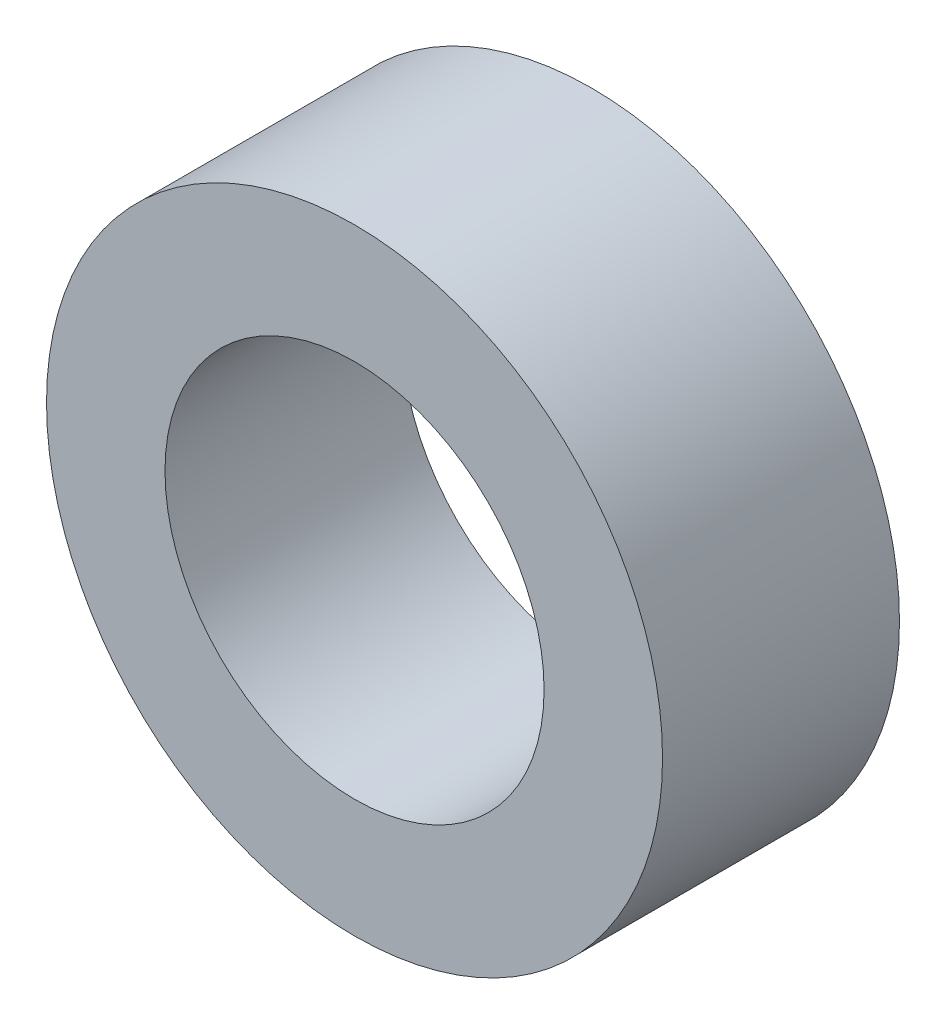
ISO-10303-21;
HEADER;
FILE_DESCRIPTION(('STEP AP214'),'2;1');
FILE_NAME('part.step','',(''),(''),'','','');
FILE_SCHEMA(('AUTOMOTIVE_DESIGN { 1 0 10303 214 1 1 1 1 }'));
ENDSEC;
DATA;
#1=APPLICATION_CONTEXT('core data for automotive mechanical design processes');
#2=APPLICATION_PROTOCOL_DEFINITION('international standard','automotive_design',2000,#1);
#3=PRODUCT_CONTEXT('',#1,'mechanical');
#4=PRODUCT('Part','Part','',(#3));
#5=PRODUCT_RELATED_PRODUCT_CATEGORY('part','',(#4));
#6=PRODUCT_DEFINITION_FORMATION('','',#4);
#7=PRODUCT_DEFINITION_CONTEXT('part definition',#1,'design');
#8=PRODUCT_DEFINITION('design','',#6,#7);
#9=PRODUCT_DEFINITION_SHAPE('','',#8);
#10=(LENGTH_UNIT() NAMED_UNIT(*) SI_UNIT(.MILLI.,.METRE.));
#11=(NAMED_UNIT(*) PLANE_ANGLE_UNIT() SI_UNIT($,.RADIAN.));
#12=(NAMED_UNIT(*) SI_UNIT($,.STERADIAN.) SOLID_ANGLE_UNIT());
#13=UNCERTAINTY_MEASURE_WITH_UNIT(LENGTH_MEASURE(1.E-05),#10,'distance_accuracy_value','');
#14=(GEOMETRIC_REPRESENTATION_CONTEXT(3) GLOBAL_UNCERTAINTY_ASSIGNED_CONTEXT((#13)) GLOBAL_UNIT_ASSIGNED_CONTEXT((#10,
#11,#12)) REPRESENTATION_CONTEXT('',''));
#15=CARTESIAN_POINT('',(0.,0.,0.));
#16=DIRECTION('',(0.,0.,1.));
#17=DIRECTION('',(1.,0.,0.));
#18=AXIS2_PLACEMENT_3D('',#15,#16,#17);
#19=CARTESIAN_POINT('',(0.,0.,5.));
#20=DIRECTION('',(0.,0.,1.));
#21=DIRECTION('',(1.,0.,0.));
#22=AXIS2_PLACEMENT_3D('',#19,#20,#21);
#23=PLANE('',#22);
#24=CARTESIAN_POINT('',(0.,0.,5.));
#25=DIRECTION('',(0.,0.,1.));
#26=DIRECTION('',(1.,0.,0.));
#27=AXIS2_PLACEMENT_3D('',#24,#25,#26);
#28=CIRCLE('',#27,6.5);
#29=CARTESIAN_POINT('',(6.5,0.,5.));
#30=VERTEX_POINT('',#29);
#31=EDGE_CURVE('E10',#30,#30,#28,.T.);
#32=ORIENTED_EDGE('',*,*,#31,.T.);
#33=EDGE_LOOP('',(#32));
#34=FACE_BOUND('',#33,.T.);
#35=CARTESIAN_POINT('',(0.,0.,5.));
#36=DIRECTION('',(0.,0.,1.));
#37=DIRECTION('',(1.,0.,0.));
#38=AXIS2_PLACEMENT_3D('',#35,#36,#37);
#39=CIRCLE('',#38,4.);
#40=CARTESIAN_POINT('',(4.,0.,5.));
#41=VERTEX_POINT('',#40);
#42=EDGE_CURVE('E42',#41,#41,#39,.T.);
#43=ORIENTED_EDGE('',*,*,#42,.F.);
#44=EDGE_LOOP('',(#43));
#45=FACE_BOUND('',#44,.T.);
#46=ADVANCED_FACE('F31',(#34,#45),#23,.T.);
#47=CARTESIAN_POINT('',(0.,0.,0.));
#48=DIRECTION('',(0.,0.,1.));
#49=DIRECTION('',(1.,0.,0.));
#50=AXIS2_PLACEMENT_3D('',#47,#48,#49);
#51=PLANE('',#50);
#52=CARTESIAN_POINT('',(0.,0.,0.));
#53=DIRECTION('',(0.,0.,1.));
#54=DIRECTION('',(1.,0.,0.));
#55=AXIS2_PLACEMENT_3D('',#52,#53,#54);
#56=CIRCLE('',#55,6.5);
#57=CARTESIAN_POINT('',(6.5,0.,0.));
#58=VERTEX_POINT('',#57);
#59=EDGE_CURVE('E35',#58,#58,#56,.T.);
#60=ORIENTED_EDGE('',*,*,#59,.F.);
#61=EDGE_LOOP('',(#60));
#62=FACE_BOUND('',#61,.T.);
#63=CARTESIAN_POINT('',(0.,0.,0.));
#64=DIRECTION('',(0.,0.,1.));
#65=DIRECTION('',(1.,0.,0.));
#66=AXIS2_PLACEMENT_3D('',#63,#64,#65);
#67=CIRCLE('',#66,4.);
#68=CARTESIAN_POINT('',(4.,0.,0.));
#69=VERTEX_POINT('',#68);
#70=EDGE_CURVE('E44',#69,#69,#67,.T.);
#71=ORIENTED_EDGE('',*,*,#70,.T.);
#72=EDGE_LOOP('',(#71));
#73=FACE_BOUND('',#72,.T.);
#74=ADVANCED_FACE('F54',(#62,#73),#51,.F.);
#75=CARTESIAN_POINT('',(0.,0.,5.));
#76=DIRECTION('',(0.,0.,-1.));
#77=DIRECTION('',(-1.,0.,0.));
#78=AXIS2_PLACEMENT_3D('',#75,#76,#77);
#79=CYLINDRICAL_SURFACE('',#78,6.5);
#80=ORIENTED_EDGE('',*,*,#31,.F.);
#81=EDGE_LOOP('',(#80));
#82=FACE_BOUND('',#81,.T.);
#83=ORIENTED_EDGE('',*,*,#59,.T.);
#84=EDGE_LOOP('',(#83));
#85=FACE_BOUND('',#84,.T.);
#86=ADVANCED_FACE('F33',(#82,#85),#79,.T.);
#87=CARTESIAN_POINT('',(0.,0.,5.));
#88=DIRECTION('',(0.,0.,-1.));
#89=DIRECTION('',(-1.,0.,0.));
#90=AXIS2_PLACEMENT_3D('',#87,#88,#89);
#91=CYLINDRICAL_SURFACE('',#90,4.);
#92=ORIENTED_EDGE('',*,*,#42,.T.);
#93=EDGE_LOOP('',(#92));
#94=FACE_BOUND('',#93,.T.);
#95=ORIENTED_EDGE('',*,*,#70,.F.);
#96=EDGE_LOOP('',(#95));
#97=FACE_BOUND('',#96,.T.);
#98=ADVANCED_FACE('F50',(#94,#97),#91,.F.);
#99=CLOSED_SHELL('',(#46,#74,#86,#98));
#100=MANIFOLD_SOLID_BREP('B2',#99);
#101=ADVANCED_BREP_SHAPE_REPRESENTATION('',(#18,#100),#14);
#102=SHAPE_DEFINITION_REPRESENTATION(#9,#101);
ENDSEC;
END-ISO-10303-21;
